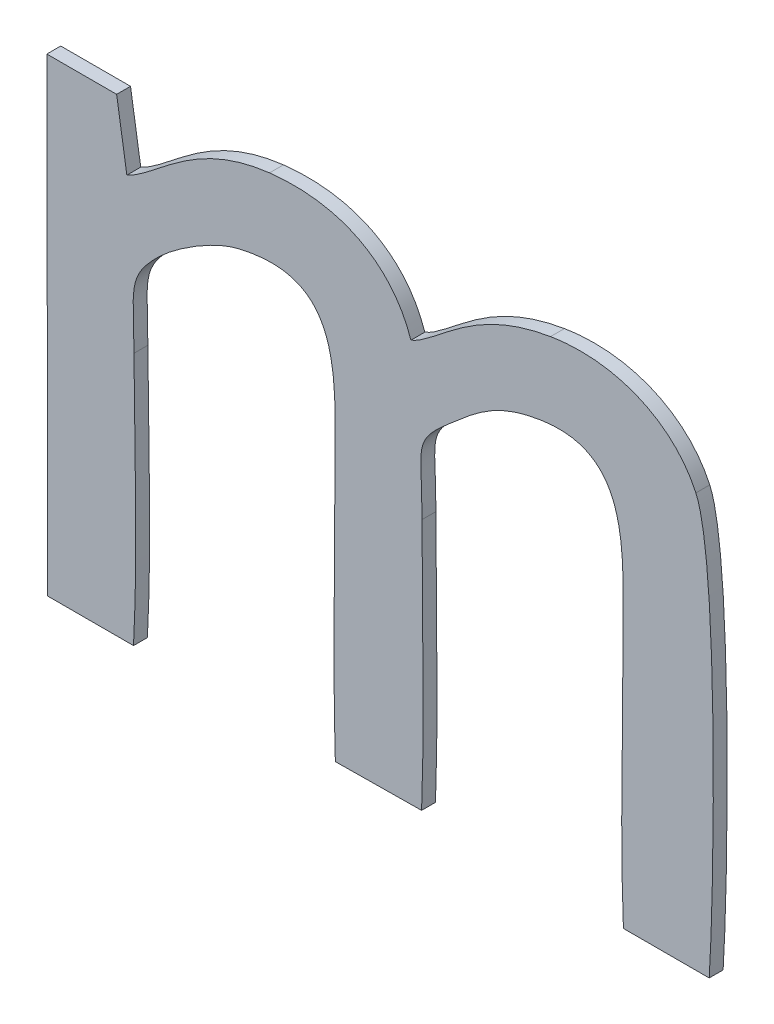
ISO-10303-21;
HEADER;
FILE_DESCRIPTION(('STEP AP214'),'2;1');
FILE_NAME('part.step','',(''),(''),'','','');
FILE_SCHEMA(('AUTOMOTIVE_DESIGN { 1 0 10303 214 1 1 1 1 }'));
ENDSEC;
DATA;
#1=APPLICATION_CONTEXT('core data for automotive mechanical design processes');
#2=APPLICATION_PROTOCOL_DEFINITION('international standard','automotive_design',2000,#1);
#3=PRODUCT_CONTEXT('',#1,'mechanical');
#4=PRODUCT('Part','Part','',(#3));
#5=PRODUCT_RELATED_PRODUCT_CATEGORY('part','',(#4));
#6=PRODUCT_DEFINITION_FORMATION('','',#4);
#7=PRODUCT_DEFINITION_CONTEXT('part definition',#1,'design');
#8=PRODUCT_DEFINITION('design','',#6,#7);
#9=PRODUCT_DEFINITION_SHAPE('','',#8);
#10=(LENGTH_UNIT() NAMED_UNIT(*) SI_UNIT(.MILLI.,.METRE.));
#11=(NAMED_UNIT(*) PLANE_ANGLE_UNIT() SI_UNIT($,.RADIAN.));
#12=(NAMED_UNIT(*) SI_UNIT($,.STERADIAN.) SOLID_ANGLE_UNIT());
#13=UNCERTAINTY_MEASURE_WITH_UNIT(LENGTH_MEASURE(1.E-05),#10,'distance_accuracy_value','');
#14=(GEOMETRIC_REPRESENTATION_CONTEXT(3) GLOBAL_UNCERTAINTY_ASSIGNED_CONTEXT((#13)) GLOBAL_UNIT_ASSIGNED_CONTEXT((#10,
#11,#12)) REPRESENTATION_CONTEXT('',''));
#15=CARTESIAN_POINT('',(0.,0.,0.));
#16=DIRECTION('',(0.,0.,1.));
#17=DIRECTION('',(1.,0.,0.));
#18=AXIS2_PLACEMENT_3D('',#15,#16,#17);
#19=CARTESIAN_POINT('',(-1.957379296875,-48.5519523828125,0.001));
#20=CARTESIAN_POINT('',(-1.957379296875,-48.5519523828125,0.));
#21=CARTESIAN_POINT('',(-1.958658984375,-48.5481453125,0.001));
#22=CARTESIAN_POINT('',(-1.958658984375,-48.5481453125,0.));
#23=CARTESIAN_POINT('',(-1.962242109375,-48.5460018359375,0.001));
#24=CARTESIAN_POINT('',(-1.962242109375,-48.5460018359375,0.));
#25=CARTESIAN_POINT('',(-1.9675528125,-48.5466096875,0.001));
#26=CARTESIAN_POINT('',(-1.9675528125,-48.5466096875,0.));
#27=B_SPLINE_SURFACE_WITH_KNOTS('',3,1,((#19,#20),(#21,#22),(#23,#24),(#25,#26)),.UNSPECIFIED.,
.F.,.F.,.F.,(4,4),(2,2),(0.681818181818182,0.727272727272727),(0.,1.),.UNSPECIFIED.);
#28=CARTESIAN_POINT('',(-1.957379296875,-48.5519523828125,0.));
#29=CARTESIAN_POINT('',(-1.958658984375,-48.5481453125,0.));
#30=CARTESIAN_POINT('',(-1.962242109375,-48.5460018359375,0.));
#31=CARTESIAN_POINT('',(-1.9675528125,-48.5466096875,0.));
#32=B_SPLINE_CURVE_WITH_KNOTS('',3,(#28,#29,#30,#31),.UNSPECIFIED.,.F.,.F.,(4,4),
(0.681818181818182,0.727272727272727),.UNSPECIFIED.);
#33=CARTESIAN_POINT('',(-1.957379296875,-48.5519523828125,0.));
#34=VERTEX_POINT('',#33);
#35=CARTESIAN_POINT('',(-1.9675528125,-48.5466096875,0.));
#36=VERTEX_POINT('',#35);
#37=EDGE_CURVE('E11',#34,#36,#32,.T.);
#38=DIRECTION('',(0.,0.,-1.));
#39=VECTOR('',#38,1.);
#40=CARTESIAN_POINT('',(-1.9675528125,-48.5466096875,0.001));
#41=LINE('',#40,#39);
#42=CARTESIAN_POINT('',(-1.9675528125,-48.5466096875,0.001));
#43=VERTEX_POINT('',#42);
#44=EDGE_CURVE('E28',#43,#36,#41,.T.);
#45=CARTESIAN_POINT('',(-1.957379296875,-48.5519523828125,0.001));
#46=CARTESIAN_POINT('',(-1.958658984375,-48.5481453125,0.001));
#47=CARTESIAN_POINT('',(-1.962242109375,-48.5460018359375,0.001));
#48=CARTESIAN_POINT('',(-1.9675528125,-48.5466096875,0.001));
#49=B_SPLINE_CURVE_WITH_KNOTS('',3,(#45,#46,#47,#48),.UNSPECIFIED.,.F.,.F.,(4,4),
(0.681818181818182,0.727272727272727),.UNSPECIFIED.);
#50=CARTESIAN_POINT('',(-1.957379296875,-48.5519523828125,0.001));
#51=VERTEX_POINT('',#50);
#52=EDGE_CURVE('E459',#51,#43,#49,.T.);
#53=DIRECTION('',(0.,0.,-1.));
#54=VECTOR('',#53,1.);
#55=CARTESIAN_POINT('',(-1.957379296875,-48.5519523828125,0.001));
#56=LINE('',#55,#54);
#57=EDGE_CURVE('E40',#51,#34,#56,.T.);
#58=ORIENTED_EDGE('',*,*,#37,.T.);
#59=ORIENTED_EDGE('',*,*,#44,.F.);
#60=ORIENTED_EDGE('',*,*,#52,.F.);
#61=ORIENTED_EDGE('',*,*,#57,.T.);
#62=EDGE_LOOP('',(#58,#59,#60,#61));
#63=FACE_BOUND('',#62,.T.);
#64=ADVANCED_FACE('F17',(#63),#27,.F.);
#65=CARTESIAN_POINT('',(-1.9675528125,-48.5466096875,0.001));
#66=CARTESIAN_POINT('',(-1.9675528125,-48.5466096875,0.));
#67=CARTESIAN_POINT('',(-1.9731514453125,-48.5472815234375,0.001));
#68=CARTESIAN_POINT('',(-1.9731514453125,-48.5472815234375,0.));
#69=CARTESIAN_POINT('',(-1.9755828515625,-48.5508646484375,0.001));
#70=CARTESIAN_POINT('',(-1.9755828515625,-48.5508646484375,0.));
#71=CARTESIAN_POINT('',(-1.9778223046875,-48.5518883984375,0.001));
#72=CARTESIAN_POINT('',(-1.9778223046875,-48.5518883984375,0.));
#73=B_SPLINE_SURFACE_WITH_KNOTS('',3,1,((#65,#66),(#67,#68),(#69,#70),(#71,#72)),.UNSPECIFIED.,
.F.,.F.,.F.,(4,4),(2,2),(0.727272727272727,0.772727272727273),(0.,1.),.UNSPECIFIED.);
#74=CARTESIAN_POINT('',(-1.9675528125,-48.5466096875,0.));
#75=CARTESIAN_POINT('',(-1.9731514453125,-48.5472815234375,0.));
#76=CARTESIAN_POINT('',(-1.9755828515625,-48.5508646484375,0.));
#77=CARTESIAN_POINT('',(-1.9778223046875,-48.5518883984375,0.));
#78=B_SPLINE_CURVE_WITH_KNOTS('',3,(#74,#75,#76,#77),.UNSPECIFIED.,.F.,.F.,(4,4),
(0.727272727272727,0.772727272727273),.UNSPECIFIED.);
#79=CARTESIAN_POINT('',(-1.9778223046875,-48.5518883984375,0.));
#80=VERTEX_POINT('',#79);
#81=EDGE_CURVE('E451',#36,#80,#78,.T.);
#82=DIRECTION('',(0.,0.,-1.));
#83=VECTOR('',#82,1.);
#84=CARTESIAN_POINT('',(-1.9778223046875,-48.5518883984375,0.001));
#85=LINE('',#84,#83);
#86=CARTESIAN_POINT('',(-1.9778223046875,-48.5518883984375,0.001));
#87=VERTEX_POINT('',#86);
#88=EDGE_CURVE('E446',#87,#80,#85,.T.);
#89=CARTESIAN_POINT('',(-1.9675528125,-48.5466096875,0.001));
#90=CARTESIAN_POINT('',(-1.9731514453125,-48.5472815234375,0.001));
#91=CARTESIAN_POINT('',(-1.9755828515625,-48.5508646484375,0.001));
#92=CARTESIAN_POINT('',(-1.9778223046875,-48.5518883984375,0.001));
#93=B_SPLINE_CURVE_WITH_KNOTS('',3,(#89,#90,#91,#92),.UNSPECIFIED.,.F.,.F.,(4,4),
(0.727272727272727,0.772727272727273),.UNSPECIFIED.);
#94=EDGE_CURVE('E442',#43,#87,#93,.T.);
#95=ORIENTED_EDGE('',*,*,#81,.T.);
#96=ORIENTED_EDGE('',*,*,#88,.F.);
#97=ORIENTED_EDGE('',*,*,#94,.F.);
#98=ORIENTED_EDGE('',*,*,#44,.T.);
#99=EDGE_LOOP('',(#95,#96,#97,#98));
#100=FACE_BOUND('',#99,.T.);
#101=ADVANCED_FACE('F467',(#100),#73,.F.);
#102=CARTESIAN_POINT('',(-9.3932937280294,-1.4797654503073,0.001));
#103=DIRECTION('',(-0.987817762671791,-0.155615126996373,0.));
#104=DIRECTION('',(0.155615126996373,-0.987817762671791,0.));
#105=AXIS2_PLACEMENT_3D('',#102,#103,#104);
#106=PLANE('',#105);
#107=DIRECTION('',(-0.155615126996373,0.987817762671791,0.));
#108=VECTOR('',#107,1.);
#109=CARTESIAN_POINT('',(-9.3932937280294,-1.4797654503073,0.));
#110=LINE('',#109,#108);
#111=CARTESIAN_POINT('',(-1.978558125,-48.5472175390625,0.));
#112=VERTEX_POINT('',#111);
#113=EDGE_CURVE('E440',#80,#112,#110,.T.);
#114=ORIENTED_EDGE('',*,*,#113,.T.);
#115=DIRECTION('',(0.,0.,-1.));
#116=VECTOR('',#115,1.);
#117=CARTESIAN_POINT('',(-1.978558125,-48.5472175390625,0.001));
#118=LINE('',#117,#116);
#119=CARTESIAN_POINT('',(-1.978558125,-48.5472175390625,0.001));
#120=VERTEX_POINT('',#119);
#121=EDGE_CURVE('E437',#120,#112,#118,.T.);
#122=ORIENTED_EDGE('',*,*,#121,.F.);
#123=DIRECTION('',(-0.155615126996373,0.987817762671791,0.));
#124=VECTOR('',#123,1.);
#125=CARTESIAN_POINT('',(-9.3932937280294,-1.4797654503073,0.001));
#126=LINE('',#125,#124);
#127=EDGE_CURVE('E434',#87,#120,#126,.T.);
#128=ORIENTED_EDGE('',*,*,#127,.F.);
#129=ORIENTED_EDGE('',*,*,#88,.T.);
#130=EDGE_LOOP('',(#114,#122,#128,#129));
#131=FACE_BOUND('',#130,.T.);
#132=ADVANCED_FACE('F471',(#131),#106,.F.);
#133=CARTESIAN_POINT('',(0.,-48.5472175390625,0.001));
#134=DIRECTION('',(0.,-1.,0.));
#135=DIRECTION('',(0.,0.,-1.));
#136=AXIS2_PLACEMENT_3D('',#133,#134,#135);
#137=PLANE('',#136);
#138=DIRECTION('',(-1.,0.,0.));
#139=VECTOR('',#138,1.);
#140=CARTESIAN_POINT('',(0.,-48.5472175390625,0.));
#141=LINE('',#140,#139);
#142=CARTESIAN_POINT('',(-1.9835808984375,-48.5472175390625,0.));
#143=VERTEX_POINT('',#142);
#144=EDGE_CURVE('E432',#112,#143,#141,.T.);
#145=ORIENTED_EDGE('',*,*,#144,.T.);
#146=DIRECTION('',(0.,0.,-1.));
#147=VECTOR('',#146,1.);
#148=CARTESIAN_POINT('',(-1.9835808984375,-48.5472175390625,0.001));
#149=LINE('',#148,#147);
#150=CARTESIAN_POINT('',(-1.9835808984375,-48.5472175390625,0.001));
#151=VERTEX_POINT('',#150);
#152=EDGE_CURVE('E429',#151,#143,#149,.T.);
#153=ORIENTED_EDGE('',*,*,#152,.F.);
#154=DIRECTION('',(-1.,0.,0.));
#155=VECTOR('',#154,1.);
#156=CARTESIAN_POINT('',(0.,-48.5472175390625,0.001));
#157=LINE('',#156,#155);
#158=EDGE_CURVE('E426',#120,#151,#157,.T.);
#159=ORIENTED_EDGE('',*,*,#158,.F.);
#160=ORIENTED_EDGE('',*,*,#121,.T.);
#161=EDGE_LOOP('',(#145,#153,#159,#160));
#162=FACE_BOUND('',#161,.T.);
#163=ADVANCED_FACE('F475',(#162),#137,.F.);
#164=CARTESIAN_POINT('',(-2.0756060789896,-0.00393479825404389,0.001));
#165=DIRECTION('',(0.999998203100012,0.0018957311907279,0.));
#166=DIRECTION('',(-0.0018957311907279,0.999998203100012,0.));
#167=AXIS2_PLACEMENT_3D('',#164,#165,#166);
#168=PLANE('',#167);
#169=DIRECTION('',(0.0018957311907279,-0.999998203100012,0.));
#170=VECTOR('',#169,1.);
#171=CARTESIAN_POINT('',(-2.0756060789896,-0.00393479825404389,0.));
#172=LINE('',#171,#170);
#173=CARTESIAN_POINT('',(-1.9835169140625,-48.580969296875,0.));
#174=VERTEX_POINT('',#173);
#175=EDGE_CURVE('E424',#143,#174,#172,.T.);
#176=ORIENTED_EDGE('',*,*,#175,.T.);
#177=DIRECTION('',(0.,0.,-1.));
#178=VECTOR('',#177,1.);
#179=CARTESIAN_POINT('',(-1.9835169140625,-48.580969296875,0.001));
#180=LINE('',#179,#178);
#181=CARTESIAN_POINT('',(-1.9835169140625,-48.580969296875,0.001));
#182=VERTEX_POINT('',#181);
#183=EDGE_CURVE('E421',#182,#174,#180,.T.);
#184=ORIENTED_EDGE('',*,*,#183,.F.);
#185=DIRECTION('',(0.0018957311907279,-0.999998203100012,0.));
#186=VECTOR('',#185,1.);
#187=CARTESIAN_POINT('',(-2.0756060789896,-0.00393479825404389,0.001));
#188=LINE('',#187,#186);
#189=EDGE_CURVE('E418',#151,#182,#188,.T.);
#190=ORIENTED_EDGE('',*,*,#189,.F.);
#191=ORIENTED_EDGE('',*,*,#152,.T.);
#192=EDGE_LOOP('',(#176,#184,#190,#191));
#193=FACE_BOUND('',#192,.T.);
#194=ADVANCED_FACE('F479',(#193),#168,.F.);
#195=CARTESIAN_POINT('',(0.,-48.580969296875,0.001));
#196=DIRECTION('',(0.,1.,0.));
#197=DIRECTION('',(0.,0.,1.));
#198=AXIS2_PLACEMENT_3D('',#195,#196,#197);
#199=PLANE('',#198);
#200=DIRECTION('',(1.,0.,0.));
#201=VECTOR('',#200,1.);
#202=CARTESIAN_POINT('',(0.,-48.580969296875,0.));
#203=LINE('',#202,#201);
#204=CARTESIAN_POINT('',(-1.977342421875,-48.580969296875,0.));
#205=VERTEX_POINT('',#204);
#206=EDGE_CURVE('E416',#174,#205,#203,.T.);
#207=ORIENTED_EDGE('',*,*,#206,.T.);
#208=DIRECTION('',(0.,0.,-1.));
#209=VECTOR('',#208,1.);
#210=CARTESIAN_POINT('',(-1.977342421875,-48.580969296875,0.001));
#211=LINE('',#210,#209);
#212=CARTESIAN_POINT('',(-1.977342421875,-48.580969296875,0.001));
#213=VERTEX_POINT('',#212);
#214=EDGE_CURVE('E413',#213,#205,#211,.T.);
#215=ORIENTED_EDGE('',*,*,#214,.F.);
#216=DIRECTION('',(1.,0.,0.));
#217=VECTOR('',#216,1.);
#218=CARTESIAN_POINT('',(0.,-48.580969296875,0.001));
#219=LINE('',#218,#217);
#220=EDGE_CURVE('E407',#182,#213,#219,.T.);
#221=ORIENTED_EDGE('',*,*,#220,.F.);
#222=ORIENTED_EDGE('',*,*,#183,.T.);
#223=EDGE_LOOP('',(#207,#215,#221,#222));
#224=FACE_BOUND('',#223,.T.);
#225=ADVANCED_FACE('F486',(#224),#199,.F.);
#226=CARTESIAN_POINT('',(-1.977342421875,-48.580969296875,0.001));
#227=CARTESIAN_POINT('',(-1.977342421875,-48.580969296875,0.));
#228=CARTESIAN_POINT('',(-1.9770225,-48.5751787109375,0.001));
#229=CARTESIAN_POINT('',(-1.9770225,-48.5751787109375,0.));
#230=CARTESIAN_POINT('',(-1.9772784375,-48.5685883203125,0.001));
#231=CARTESIAN_POINT('',(-1.9772784375,-48.5685883203125,0.));
#232=CARTESIAN_POINT('',(-1.9773104296875,-48.56273375,0.001));
#233=CARTESIAN_POINT('',(-1.9773104296875,-48.56273375,0.));
#234=B_SPLINE_SURFACE_WITH_KNOTS('',3,1,((#226,#227),(#228,#229),(#230,#231),(#232,#233)),
.UNSPECIFIED.,.F.,.F.,.F.,(4,4),(2,2),(0.,0.0454545454545455),(0.,1.),.UNSPECIFIED.);
#235=CARTESIAN_POINT('',(-1.977342421875,-48.580969296875,0.));
#236=CARTESIAN_POINT('',(-1.9770225,-48.5751787109375,0.));
#237=CARTESIAN_POINT('',(-1.9772784375,-48.5685883203125,0.));
#238=CARTESIAN_POINT('',(-1.9773104296875,-48.56273375,0.));
#239=B_SPLINE_CURVE_WITH_KNOTS('',3,(#235,#236,#237,#238),.UNSPECIFIED.,.F.,.F.,(4,4),(0.,
0.0454545454545455),.UNSPECIFIED.);
#240=CARTESIAN_POINT('',(-1.9773104296875,-48.56273375,0.));
#241=VERTEX_POINT('',#240);
#242=EDGE_CURVE('E402',#205,#241,#239,.T.);
#243=DIRECTION('',(0.,0.,-1.));
#244=VECTOR('',#243,1.);
#245=CARTESIAN_POINT('',(-1.9773104296875,-48.56273375,0.001));
#246=LINE('',#245,#244);
#247=CARTESIAN_POINT('',(-1.9773104296875,-48.56273375,0.001));
#248=VERTEX_POINT('',#247);
#249=EDGE_CURVE('E397',#248,#241,#246,.T.);
#250=CARTESIAN_POINT('',(-1.977342421875,-48.580969296875,0.001));
#251=CARTESIAN_POINT('',(-1.9770225,-48.5751787109375,0.001));
#252=CARTESIAN_POINT('',(-1.9772784375,-48.5685883203125,0.001));
#253=CARTESIAN_POINT('',(-1.9773104296875,-48.56273375,0.001));
#254=B_SPLINE_CURVE_WITH_KNOTS('',3,(#250,#251,#252,#253),.UNSPECIFIED.,.F.,.F.,(4,4),(0.,
0.0454545454545455),.UNSPECIFIED.);
#255=EDGE_CURVE('E390',#213,#248,#254,.T.);
#256=ORIENTED_EDGE('',*,*,#242,.T.);
#257=ORIENTED_EDGE('',*,*,#249,.F.);
#258=ORIENTED_EDGE('',*,*,#255,.F.);
#259=ORIENTED_EDGE('',*,*,#214,.T.);
#260=EDGE_LOOP('',(#256,#257,#258,#259));
#261=FACE_BOUND('',#260,.T.);
#262=ADVANCED_FACE('F490',(#261),#234,.F.);
#263=CARTESIAN_POINT('',(-1.9773104296875,-48.56273375,0.001));
#264=CARTESIAN_POINT('',(-1.9773104296875,-48.56273375,0.));
#265=CARTESIAN_POINT('',(-1.9773104296875,-48.5587347265625,0.001));
#266=CARTESIAN_POINT('',(-1.9773104296875,-48.5587347265625,0.));
#267=CARTESIAN_POINT('',(-1.9778862890625,-48.5580948828125,0.001));
#268=CARTESIAN_POINT('',(-1.9778862890625,-48.5580948828125,0.));
#269=CARTESIAN_POINT('',(-1.9754548828125,-48.555759453125,0.001));
#270=CARTESIAN_POINT('',(-1.9754548828125,-48.555759453125,0.));
#271=B_SPLINE_SURFACE_WITH_KNOTS('',3,1,((#263,#264),(#265,#266),(#267,#268),(#269,#270)),
.UNSPECIFIED.,.F.,.F.,.F.,(4,4),(2,2),(0.0454545454545455,0.0909090909090909),(0.,1.),.UNSPECIFIED.);
#272=CARTESIAN_POINT('',(-1.9773104296875,-48.56273375,0.));
#273=CARTESIAN_POINT('',(-1.9773104296875,-48.5587347265625,0.));
#274=CARTESIAN_POINT('',(-1.9778862890625,-48.5580948828125,0.));
#275=CARTESIAN_POINT('',(-1.9754548828125,-48.555759453125,0.));
#276=B_SPLINE_CURVE_WITH_KNOTS('',3,(#272,#273,#274,#275),.UNSPECIFIED.,.F.,.F.,(4,4),
(0.0454545454545455,0.0909090909090909),.UNSPECIFIED.);
#277=CARTESIAN_POINT('',(-1.9754548828125,-48.555759453125,0.));
#278=VERTEX_POINT('',#277);
#279=EDGE_CURVE('E385',#241,#278,#276,.T.);
#280=DIRECTION('',(0.,0.,-1.));
#281=VECTOR('',#280,1.);
#282=CARTESIAN_POINT('',(-1.9754548828125,-48.555759453125,0.001));
#283=LINE('',#282,#281);
#284=CARTESIAN_POINT('',(-1.9754548828125,-48.555759453125,0.001));
#285=VERTEX_POINT('',#284);
#286=EDGE_CURVE('E380',#285,#278,#283,.T.);
#287=CARTESIAN_POINT('',(-1.9773104296875,-48.56273375,0.001));
#288=CARTESIAN_POINT('',(-1.9773104296875,-48.5587347265625,0.001));
#289=CARTESIAN_POINT('',(-1.9778862890625,-48.5580948828125,0.001));
#290=CARTESIAN_POINT('',(-1.9754548828125,-48.555759453125,0.001));
#291=B_SPLINE_CURVE_WITH_KNOTS('',3,(#287,#288,#289,#290),.UNSPECIFIED.,.F.,.F.,(4,4),
(0.0454545454545455,0.0909090909090909),.UNSPECIFIED.);
#292=EDGE_CURVE('E373',#248,#285,#291,.T.);
#293=ORIENTED_EDGE('',*,*,#279,.T.);
#294=ORIENTED_EDGE('',*,*,#286,.F.);
#295=ORIENTED_EDGE('',*,*,#292,.F.);
#296=ORIENTED_EDGE('',*,*,#249,.T.);
#297=EDGE_LOOP('',(#293,#294,#295,#296));
#298=FACE_BOUND('',#297,.T.);
#299=ADVANCED_FACE('F497',(#298),#271,.F.);
#300=CARTESIAN_POINT('',(-1.9754548828125,-48.555759453125,0.001));
#301=CARTESIAN_POINT('',(-1.9754548828125,-48.555759453125,0.));
#302=CARTESIAN_POINT('',(-1.974399140625,-48.554735703125,0.001));
#303=CARTESIAN_POINT('',(-1.974399140625,-48.554735703125,0.));
#304=CARTESIAN_POINT('',(-1.97177578125,-48.552944140625,0.001));
#305=CARTESIAN_POINT('',(-1.97177578125,-48.552944140625,0.));
#306=CARTESIAN_POINT('',(-1.9698242578125,-48.5524642578125,0.001));
#307=CARTESIAN_POINT('',(-1.9698242578125,-48.5524642578125,0.));
#308=B_SPLINE_SURFACE_WITH_KNOTS('',3,1,((#300,#301),(#302,#303),(#304,#305),(#306,#307)),
.UNSPECIFIED.,.F.,.F.,.F.,(4,4),(2,2),(0.0909090909090909,0.136363636363636),(0.,1.),.UNSPECIFIED.);
#309=CARTESIAN_POINT('',(-1.9754548828125,-48.555759453125,0.));
#310=CARTESIAN_POINT('',(-1.974399140625,-48.554735703125,0.));
#311=CARTESIAN_POINT('',(-1.97177578125,-48.552944140625,0.));
#312=CARTESIAN_POINT('',(-1.9698242578125,-48.5524642578125,0.));
#313=B_SPLINE_CURVE_WITH_KNOTS('',3,(#309,#310,#311,#312),.UNSPECIFIED.,.F.,.F.,(4,4),
(0.0909090909090909,0.136363636363636),.UNSPECIFIED.);
#314=CARTESIAN_POINT('',(-1.9698242578125,-48.5524642578125,0.));
#315=VERTEX_POINT('',#314);
#316=EDGE_CURVE('E368',#278,#315,#313,.T.);
#317=DIRECTION('',(0.,0.,-1.));
#318=VECTOR('',#317,1.);
#319=CARTESIAN_POINT('',(-1.9698242578125,-48.5524642578125,0.001));
#320=LINE('',#319,#318);
#321=CARTESIAN_POINT('',(-1.9698242578125,-48.5524642578125,0.001));
#322=VERTEX_POINT('',#321);
#323=EDGE_CURVE('E363',#322,#315,#320,.T.);
#324=CARTESIAN_POINT('',(-1.9754548828125,-48.555759453125,0.001));
#325=CARTESIAN_POINT('',(-1.974399140625,-48.554735703125,0.001));
#326=CARTESIAN_POINT('',(-1.97177578125,-48.552944140625,0.001));
#327=CARTESIAN_POINT('',(-1.9698242578125,-48.5524642578125,0.001));
#328=B_SPLINE_CURVE_WITH_KNOTS('',3,(#324,#325,#326,#327),.UNSPECIFIED.,.F.,.F.,(4,4),
(0.0909090909090909,0.136363636363636),.UNSPECIFIED.);
#329=EDGE_CURVE('E356',#285,#322,#328,.T.);
#330=ORIENTED_EDGE('',*,*,#316,.T.);
#331=ORIENTED_EDGE('',*,*,#323,.F.);
#332=ORIENTED_EDGE('',*,*,#329,.F.);
#333=ORIENTED_EDGE('',*,*,#286,.T.);
#334=EDGE_LOOP('',(#330,#331,#332,#333));
#335=FACE_BOUND('',#334,.T.);
#336=ADVANCED_FACE('F500',(#335),#308,.F.);
#337=CARTESIAN_POINT('',(-1.9698242578125,-48.5524642578125,0.001));
#338=CARTESIAN_POINT('',(-1.9698242578125,-48.5524642578125,0.));
#339=CARTESIAN_POINT('',(-1.96205015625,-48.55057671875,0.001));
#340=CARTESIAN_POINT('',(-1.96205015625,-48.55057671875,0.));
#341=CARTESIAN_POINT('',(-1.9628499609375,-48.55723109375,0.001));
#342=CARTESIAN_POINT('',(-1.9628499609375,-48.55723109375,0.));
#343=CARTESIAN_POINT('',(-1.9628499609375,-48.5631496484375,0.001));
#344=CARTESIAN_POINT('',(-1.9628499609375,-48.5631496484375,0.));
#345=B_SPLINE_SURFACE_WITH_KNOTS('',3,1,((#337,#338),(#339,#340),(#341,#342),(#343,#344)),
.UNSPECIFIED.,.F.,.F.,.F.,(4,4),(2,2),(0.136363636363636,0.181818181818182),(0.,1.),.UNSPECIFIED.);
#346=CARTESIAN_POINT('',(-1.9698242578125,-48.5524642578125,0.));
#347=CARTESIAN_POINT('',(-1.96205015625,-48.55057671875,0.));
#348=CARTESIAN_POINT('',(-1.9628499609375,-48.55723109375,0.));
#349=CARTESIAN_POINT('',(-1.9628499609375,-48.5631496484375,0.));
#350=B_SPLINE_CURVE_WITH_KNOTS('',3,(#346,#347,#348,#349),.UNSPECIFIED.,.F.,.F.,(4,4),
(0.136363636363636,0.181818181818182),.UNSPECIFIED.);
#351=CARTESIAN_POINT('',(-1.9628499609375,-48.5631496484375,0.));
#352=VERTEX_POINT('',#351);
#353=EDGE_CURVE('E351',#315,#352,#350,.T.);
#354=DIRECTION('',(0.,0.,-1.));
#355=VECTOR('',#354,1.);
#356=CARTESIAN_POINT('',(-1.9628499609375,-48.5631496484375,0.001));
#357=LINE('',#356,#355);
#358=CARTESIAN_POINT('',(-1.9628499609375,-48.5631496484375,0.001));
#359=VERTEX_POINT('',#358);
#360=EDGE_CURVE('E346',#359,#352,#357,.T.);
#361=CARTESIAN_POINT('',(-1.9698242578125,-48.5524642578125,0.001));
#362=CARTESIAN_POINT('',(-1.96205015625,-48.55057671875,0.001));
#363=CARTESIAN_POINT('',(-1.9628499609375,-48.55723109375,0.001));
#364=CARTESIAN_POINT('',(-1.9628499609375,-48.5631496484375,0.001));
#365=B_SPLINE_CURVE_WITH_KNOTS('',3,(#361,#362,#363,#364),.UNSPECIFIED.,.F.,.F.,(4,4),
(0.136363636363636,0.181818181818182),.UNSPECIFIED.);
#366=EDGE_CURVE('E339',#322,#359,#365,.T.);
#367=ORIENTED_EDGE('',*,*,#353,.T.);
#368=ORIENTED_EDGE('',*,*,#360,.F.);
#369=ORIENTED_EDGE('',*,*,#366,.F.);
#370=ORIENTED_EDGE('',*,*,#323,.T.);
#371=EDGE_LOOP('',(#367,#368,#369,#370));
#372=FACE_BOUND('',#371,.T.);
#373=ADVANCED_FACE('F505',(#372),#345,.F.);
#374=CARTESIAN_POINT('',(-1.9628499609375,-48.5631496484375,0.001));
#375=CARTESIAN_POINT('',(-1.9628499609375,-48.5631496484375,0.));
#376=CARTESIAN_POINT('',(-1.9628499609375,-48.5689722265625,0.001));
#377=CARTESIAN_POINT('',(-1.9628499609375,-48.5689722265625,0.));
#378=CARTESIAN_POINT('',(-1.963009921875,-48.5749867578125,0.001));
#379=CARTESIAN_POINT('',(-1.963009921875,-48.5749867578125,0.));
#380=CARTESIAN_POINT('',(-1.96281796875,-48.5809373046875,0.001));
#381=CARTESIAN_POINT('',(-1.96281796875,-48.5809373046875,0.));
#382=B_SPLINE_SURFACE_WITH_KNOTS('',3,1,((#374,#375),(#376,#377),(#378,#379),(#380,#381)),
.UNSPECIFIED.,.F.,.F.,.F.,(4,4),(2,2),(0.181818181818182,0.227272727272727),(0.,1.),.UNSPECIFIED.);
#383=CARTESIAN_POINT('',(-1.9628499609375,-48.5631496484375,0.));
#384=CARTESIAN_POINT('',(-1.9628499609375,-48.5689722265625,0.));
#385=CARTESIAN_POINT('',(-1.963009921875,-48.5749867578125,0.));
#386=CARTESIAN_POINT('',(-1.96281796875,-48.5809373046875,0.));
#387=B_SPLINE_CURVE_WITH_KNOTS('',3,(#383,#384,#385,#386),.UNSPECIFIED.,.F.,.F.,(4,4),
(0.181818181818182,0.227272727272727),.UNSPECIFIED.);
#388=CARTESIAN_POINT('',(-1.96281796875,-48.5809373046875,0.));
#389=VERTEX_POINT('',#388);
#390=EDGE_CURVE('E334',#352,#389,#387,.T.);
#391=DIRECTION('',(0.,0.,-1.));
#392=VECTOR('',#391,1.);
#393=CARTESIAN_POINT('',(-1.96281796875,-48.5809373046875,0.001));
#394=LINE('',#393,#392);
#395=CARTESIAN_POINT('',(-1.96281796875,-48.5809373046875,0.001));
#396=VERTEX_POINT('',#395);
#397=EDGE_CURVE('E329',#396,#389,#394,.T.);
#398=CARTESIAN_POINT('',(-1.9628499609375,-48.5631496484375,0.001));
#399=CARTESIAN_POINT('',(-1.9628499609375,-48.5689722265625,0.001));
#400=CARTESIAN_POINT('',(-1.963009921875,-48.5749867578125,0.001));
#401=CARTESIAN_POINT('',(-1.96281796875,-48.5809373046875,0.001));
#402=B_SPLINE_CURVE_WITH_KNOTS('',3,(#398,#399,#400,#401),.UNSPECIFIED.,.F.,.F.,(4,4),
(0.181818181818182,0.227272727272727),.UNSPECIFIED.);
#403=EDGE_CURVE('E325',#359,#396,#402,.T.);
#404=ORIENTED_EDGE('',*,*,#390,.T.);
#405=ORIENTED_EDGE('',*,*,#397,.F.);
#406=ORIENTED_EDGE('',*,*,#403,.F.);
#407=ORIENTED_EDGE('',*,*,#360,.T.);
#408=EDGE_LOOP('',(#404,#405,#406,#407));
#409=FACE_BOUND('',#408,.T.);
#410=ADVANCED_FACE('F511',(#409),#382,.F.);
#411=CARTESIAN_POINT('',(0.500572593100432,-48.5555415256967,0.001));
#412=DIRECTION('',(-0.0103087305539108,0.999946863625446,0.));
#413=DIRECTION('',(-0.999946863625446,-0.0103087305539108,0.));
#414=AXIS2_PLACEMENT_3D('',#411,#412,#413);
#415=PLANE('',#414);
#416=DIRECTION('',(0.999946863625446,0.0103087305539108,0.));
#417=VECTOR('',#416,1.);
#418=CARTESIAN_POINT('',(0.500572593100432,-48.5555415256967,0.));
#419=LINE('',#418,#417);
#420=CARTESIAN_POINT('',(-1.956611484375,-48.5808733203125,0.));
#421=VERTEX_POINT('',#420);
#422=EDGE_CURVE('E323',#389,#421,#419,.T.);
#423=ORIENTED_EDGE('',*,*,#422,.T.);
#424=DIRECTION('',(0.,0.,-1.));
#425=VECTOR('',#424,1.);
#426=CARTESIAN_POINT('',(-1.956611484375,-48.5808733203125,0.001));
#427=LINE('',#426,#425);
#428=CARTESIAN_POINT('',(-1.956611484375,-48.5808733203125,0.001));
#429=VERTEX_POINT('',#428);
#430=EDGE_CURVE('E320',#429,#421,#427,.T.);
#431=ORIENTED_EDGE('',*,*,#430,.F.);
#432=DIRECTION('',(0.999946863625446,0.0103087305539108,0.));
#433=VECTOR('',#432,1.);
#434=CARTESIAN_POINT('',(0.500572593100432,-48.5555415256967,0.001));
#435=LINE('',#434,#433);
#436=EDGE_CURVE('E314',#396,#429,#435,.T.);
#437=ORIENTED_EDGE('',*,*,#436,.F.);
#438=ORIENTED_EDGE('',*,*,#397,.T.);
#439=EDGE_LOOP('',(#423,#431,#437,#438));
#440=FACE_BOUND('',#439,.T.);
#441=ADVANCED_FACE('F515',(#440),#415,.F.);
#442=CARTESIAN_POINT('',(-1.956611484375,-48.5808733203125,0.001));
#443=CARTESIAN_POINT('',(-1.956611484375,-48.5808733203125,0.));
#444=CARTESIAN_POINT('',(-1.9563875390625,-48.5749867578125,0.001));
#445=CARTESIAN_POINT('',(-1.9563875390625,-48.5749867578125,0.));
#446=CARTESIAN_POINT('',(-1.9565794921875,-48.568684296875,0.001));
#447=CARTESIAN_POINT('',(-1.9565794921875,-48.568684296875,0.));
#448=CARTESIAN_POINT('',(-1.9565794921875,-48.56273375,0.001));
#449=CARTESIAN_POINT('',(-1.9565794921875,-48.56273375,0.));
#450=B_SPLINE_SURFACE_WITH_KNOTS('',3,1,((#442,#443),(#444,#445),(#446,#447),(#448,#449)),
.UNSPECIFIED.,.F.,.F.,.F.,(4,4),(2,2),(0.272727272727273,0.318181818181818),(0.,1.),.UNSPECIFIED.);
#451=CARTESIAN_POINT('',(-1.956611484375,-48.5808733203125,0.));
#452=CARTESIAN_POINT('',(-1.9563875390625,-48.5749867578125,0.));
#453=CARTESIAN_POINT('',(-1.9565794921875,-48.568684296875,0.));
#454=CARTESIAN_POINT('',(-1.9565794921875,-48.56273375,0.));
#455=B_SPLINE_CURVE_WITH_KNOTS('',3,(#451,#452,#453,#454),.UNSPECIFIED.,.F.,.F.,(4,4),
(0.272727272727273,0.318181818181818),.UNSPECIFIED.);
#456=CARTESIAN_POINT('',(-1.9565794921875,-48.56273375,0.));
#457=VERTEX_POINT('',#456);
#458=EDGE_CURVE('E309',#421,#457,#455,.T.);
#459=DIRECTION('',(0.,0.,-1.));
#460=VECTOR('',#459,1.);
#461=CARTESIAN_POINT('',(-1.9565794921875,-48.56273375,0.001));
#462=LINE('',#461,#460);
#463=CARTESIAN_POINT('',(-1.9565794921875,-48.56273375,0.001));
#464=VERTEX_POINT('',#463);
#465=EDGE_CURVE('E304',#464,#457,#462,.T.);
#466=CARTESIAN_POINT('',(-1.956611484375,-48.5808733203125,0.001));
#467=CARTESIAN_POINT('',(-1.9563875390625,-48.5749867578125,0.001));
#468=CARTESIAN_POINT('',(-1.9565794921875,-48.568684296875,0.001));
#469=CARTESIAN_POINT('',(-1.9565794921875,-48.56273375,0.001));
#470=B_SPLINE_CURVE_WITH_KNOTS('',3,(#466,#467,#468,#469),.UNSPECIFIED.,.F.,.F.,(4,4),
(0.272727272727273,0.318181818181818),.UNSPECIFIED.);
#471=EDGE_CURVE('E297',#429,#464,#470,.T.);
#472=ORIENTED_EDGE('',*,*,#458,.T.);
#473=ORIENTED_EDGE('',*,*,#465,.F.);
#474=ORIENTED_EDGE('',*,*,#471,.F.);
#475=ORIENTED_EDGE('',*,*,#430,.T.);
#476=EDGE_LOOP('',(#472,#473,#474,#475));
#477=FACE_BOUND('',#476,.T.);
#478=ADVANCED_FACE('F518',(#477),#450,.F.);
#479=CARTESIAN_POINT('',(-1.9565794921875,-48.56273375,0.001));
#480=CARTESIAN_POINT('',(-1.9565794921875,-48.56273375,0.));
#481=CARTESIAN_POINT('',(-1.9565794921875,-48.558062890625,0.001));
#482=CARTESIAN_POINT('',(-1.9565794921875,-48.558062890625,0.));
#483=CARTESIAN_POINT('',(-1.9573153125,-48.5580948828125,0.001));
#484=CARTESIAN_POINT('',(-1.9573153125,-48.5580948828125,0.));
#485=CARTESIAN_POINT('',(-1.954563984375,-48.5557274609375,0.001));
#486=CARTESIAN_POINT('',(-1.954563984375,-48.5557274609375,0.));
#487=B_SPLINE_SURFACE_WITH_KNOTS('',3,1,((#479,#480),(#481,#482),(#483,#484),(#485,#486)),
.UNSPECIFIED.,.F.,.F.,.F.,(4,4),(2,2),(0.318181818181818,0.363636363636364),(0.,1.),.UNSPECIFIED.);
#488=CARTESIAN_POINT('',(-1.9565794921875,-48.56273375,0.));
#489=CARTESIAN_POINT('',(-1.9565794921875,-48.558062890625,0.));
#490=CARTESIAN_POINT('',(-1.9573153125,-48.5580948828125,0.));
#491=CARTESIAN_POINT('',(-1.954563984375,-48.5557274609375,0.));
#492=B_SPLINE_CURVE_WITH_KNOTS('',3,(#488,#489,#490,#491),.UNSPECIFIED.,.F.,.F.,(4,4),
(0.318181818181818,0.363636363636364),.UNSPECIFIED.);
#493=CARTESIAN_POINT('',(-1.954563984375,-48.5557274609375,0.));
#494=VERTEX_POINT('',#493);
#495=EDGE_CURVE('E292',#457,#494,#492,.T.);
#496=DIRECTION('',(0.,0.,-1.));
#497=VECTOR('',#496,1.);
#498=CARTESIAN_POINT('',(-1.954563984375,-48.5557274609375,0.001));
#499=LINE('',#498,#497);
#500=CARTESIAN_POINT('',(-1.954563984375,-48.5557274609375,0.001));
#501=VERTEX_POINT('',#500);
#502=EDGE_CURVE('E287',#501,#494,#499,.T.);
#503=CARTESIAN_POINT('',(-1.9565794921875,-48.56273375,0.001));
#504=CARTESIAN_POINT('',(-1.9565794921875,-48.558062890625,0.001));
#505=CARTESIAN_POINT('',(-1.9573153125,-48.5580948828125,0.001));
#506=CARTESIAN_POINT('',(-1.954563984375,-48.5557274609375,0.001));
#507=B_SPLINE_CURVE_WITH_KNOTS('',3,(#503,#504,#505,#506),.UNSPECIFIED.,.F.,.F.,(4,4),
(0.318181818181818,0.363636363636364),.UNSPECIFIED.);
#508=EDGE_CURVE('E280',#464,#501,#507,.T.);
#509=ORIENTED_EDGE('',*,*,#495,.T.);
#510=ORIENTED_EDGE('',*,*,#502,.F.);
#511=ORIENTED_EDGE('',*,*,#508,.F.);
#512=ORIENTED_EDGE('',*,*,#465,.T.);
#513=EDGE_LOOP('',(#509,#510,#511,#512));
#514=FACE_BOUND('',#513,.T.);
#515=ADVANCED_FACE('F525',(#514),#487,.F.);
#516=CARTESIAN_POINT('',(-1.954563984375,-48.5557274609375,0.001));
#517=CARTESIAN_POINT('',(-1.954563984375,-48.5557274609375,0.));
#518=CARTESIAN_POINT('',(-1.952964375,-48.554351796875,0.001));
#519=CARTESIAN_POINT('',(-1.952964375,-48.554351796875,0.));
#520=CARTESIAN_POINT('',(-1.9515247265625,-48.553008125,0.001));
#521=CARTESIAN_POINT('',(-1.9515247265625,-48.553008125,0.));
#522=CARTESIAN_POINT('',(-1.948933359375,-48.552432265625,0.001));
#523=CARTESIAN_POINT('',(-1.948933359375,-48.552432265625,0.));
#524=B_SPLINE_SURFACE_WITH_KNOTS('',3,1,((#516,#517),(#518,#519),(#520,#521),(#522,#523)),
.UNSPECIFIED.,.F.,.F.,.F.,(4,4),(2,2),(0.363636363636364,0.409090909090909),(0.,1.),.UNSPECIFIED.);
#525=CARTESIAN_POINT('',(-1.954563984375,-48.5557274609375,0.));
#526=CARTESIAN_POINT('',(-1.952964375,-48.554351796875,0.));
#527=CARTESIAN_POINT('',(-1.9515247265625,-48.553008125,0.));
#528=CARTESIAN_POINT('',(-1.948933359375,-48.552432265625,0.));
#529=B_SPLINE_CURVE_WITH_KNOTS('',3,(#525,#526,#527,#528),.UNSPECIFIED.,.F.,.F.,(4,4),
(0.363636363636364,0.409090909090909),.UNSPECIFIED.);
#530=CARTESIAN_POINT('',(-1.948933359375,-48.552432265625,0.));
#531=VERTEX_POINT('',#530);
#532=EDGE_CURVE('E275',#494,#531,#529,.T.);
#533=DIRECTION('',(0.,0.,-1.));
#534=VECTOR('',#533,1.);
#535=CARTESIAN_POINT('',(-1.948933359375,-48.552432265625,0.001));
#536=LINE('',#535,#534);
#537=CARTESIAN_POINT('',(-1.948933359375,-48.552432265625,0.001));
#538=VERTEX_POINT('',#537);
#539=EDGE_CURVE('E270',#538,#531,#536,.T.);
#540=CARTESIAN_POINT('',(-1.954563984375,-48.5557274609375,0.001));
#541=CARTESIAN_POINT('',(-1.952964375,-48.554351796875,0.001));
#542=CARTESIAN_POINT('',(-1.9515247265625,-48.553008125,0.001));
#543=CARTESIAN_POINT('',(-1.948933359375,-48.552432265625,0.001));
#544=B_SPLINE_CURVE_WITH_KNOTS('',3,(#540,#541,#542,#543),.UNSPECIFIED.,.F.,.F.,(4,4),
(0.363636363636364,0.409090909090909),.UNSPECIFIED.);
#545=EDGE_CURVE('E263',#501,#538,#544,.T.);
#546=ORIENTED_EDGE('',*,*,#532,.T.);
#547=ORIENTED_EDGE('',*,*,#539,.F.);
#548=ORIENTED_EDGE('',*,*,#545,.F.);
#549=ORIENTED_EDGE('',*,*,#502,.T.);
#550=EDGE_LOOP('',(#546,#547,#548,#549));
#551=FACE_BOUND('',#550,.T.);
#552=ADVANCED_FACE('F532',(#551),#524,.F.);
#553=CARTESIAN_POINT('',(-1.948933359375,-48.552432265625,0.001));
#554=CARTESIAN_POINT('',(-1.948933359375,-48.552432265625,0.));
#555=CARTESIAN_POINT('',(-1.941383203125,-48.5506726953125,0.001));
#556=CARTESIAN_POINT('',(-1.941383203125,-48.5506726953125,0.));
#557=CARTESIAN_POINT('',(-1.9421190234375,-48.5574550390625,0.001));
#558=CARTESIAN_POINT('',(-1.9421190234375,-48.5574550390625,0.));
#559=CARTESIAN_POINT('',(-1.9421190234375,-48.5631496484375,0.001));
#560=CARTESIAN_POINT('',(-1.9421190234375,-48.5631496484375,0.));
#561=B_SPLINE_SURFACE_WITH_KNOTS('',3,1,((#553,#554),(#555,#556),(#557,#558),(#559,#560)),
.UNSPECIFIED.,.F.,.F.,.F.,(4,4),(2,2),(0.409090909090909,0.454545454545455),(0.,1.),.UNSPECIFIED.);
#562=CARTESIAN_POINT('',(-1.948933359375,-48.552432265625,0.));
#563=CARTESIAN_POINT('',(-1.941383203125,-48.5506726953125,0.));
#564=CARTESIAN_POINT('',(-1.9421190234375,-48.5574550390625,0.));
#565=CARTESIAN_POINT('',(-1.9421190234375,-48.5631496484375,0.));
#566=B_SPLINE_CURVE_WITH_KNOTS('',3,(#562,#563,#564,#565),.UNSPECIFIED.,.F.,.F.,(4,4),
(0.409090909090909,0.454545454545455),.UNSPECIFIED.);
#567=CARTESIAN_POINT('',(-1.9421190234375,-48.5631496484375,0.));
#568=VERTEX_POINT('',#567);
#569=EDGE_CURVE('E258',#531,#568,#566,.T.);
#570=DIRECTION('',(0.,0.,-1.));
#571=VECTOR('',#570,1.);
#572=CARTESIAN_POINT('',(-1.9421190234375,-48.5631496484375,0.001));
#573=LINE('',#572,#571);
#574=CARTESIAN_POINT('',(-1.9421190234375,-48.5631496484375,0.001));
#575=VERTEX_POINT('',#574);
#576=EDGE_CURVE('E253',#575,#568,#573,.T.);
#577=CARTESIAN_POINT('',(-1.948933359375,-48.552432265625,0.001));
#578=CARTESIAN_POINT('',(-1.941383203125,-48.5506726953125,0.001));
#579=CARTESIAN_POINT('',(-1.9421190234375,-48.5574550390625,0.001));
#580=CARTESIAN_POINT('',(-1.9421190234375,-48.5631496484375,0.001));
#581=B_SPLINE_CURVE_WITH_KNOTS('',3,(#577,#578,#579,#580),.UNSPECIFIED.,.F.,.F.,(4,4),
(0.409090909090909,0.454545454545455),.UNSPECIFIED.);
#582=EDGE_CURVE('E246',#538,#575,#581,.T.);
#583=ORIENTED_EDGE('',*,*,#569,.T.);
#584=ORIENTED_EDGE('',*,*,#576,.F.);
#585=ORIENTED_EDGE('',*,*,#582,.F.);
#586=ORIENTED_EDGE('',*,*,#539,.T.);
#587=EDGE_LOOP('',(#583,#584,#585,#586));
#588=FACE_BOUND('',#587,.T.);
#589=ADVANCED_FACE('F534',(#588),#561,.F.);
#590=CARTESIAN_POINT('',(-1.9421190234375,-48.5631496484375,0.001));
#591=CARTESIAN_POINT('',(-1.9421190234375,-48.5631496484375,0.));
#592=CARTESIAN_POINT('',(-1.9421190234375,-48.568940234375,0.001));
#593=CARTESIAN_POINT('',(-1.9421190234375,-48.568940234375,0.));
#594=CARTESIAN_POINT('',(-1.94234296875,-48.575210703125,0.001));
#595=CARTESIAN_POINT('',(-1.94234296875,-48.575210703125,0.));
#596=CARTESIAN_POINT('',(-1.94208703125,-48.580969296875,0.001));
#597=CARTESIAN_POINT('',(-1.94208703125,-48.580969296875,0.));
#598=B_SPLINE_SURFACE_WITH_KNOTS('',3,1,((#590,#591),(#592,#593),(#594,#595),(#596,#597)),
.UNSPECIFIED.,.F.,.F.,.F.,(4,4),(2,2),(0.454545454545455,0.5),(0.,1.),.UNSPECIFIED.);
#599=CARTESIAN_POINT('',(-1.9421190234375,-48.5631496484375,0.));
#600=CARTESIAN_POINT('',(-1.9421190234375,-48.568940234375,0.));
#601=CARTESIAN_POINT('',(-1.94234296875,-48.575210703125,0.));
#602=CARTESIAN_POINT('',(-1.94208703125,-48.580969296875,0.));
#603=B_SPLINE_CURVE_WITH_KNOTS('',3,(#599,#600,#601,#602),.UNSPECIFIED.,.F.,.F.,(4,4),
(0.454545454545455,0.5),.UNSPECIFIED.);
#604=CARTESIAN_POINT('',(-1.94208703125,-48.580969296875,0.));
#605=VERTEX_POINT('',#604);
#606=EDGE_CURVE('E241',#568,#605,#603,.T.);
#607=DIRECTION('',(0.,0.,-1.));
#608=VECTOR('',#607,1.);
#609=CARTESIAN_POINT('',(-1.94208703125,-48.580969296875,0.001));
#610=LINE('',#609,#608);
#611=CARTESIAN_POINT('',(-1.94208703125,-48.580969296875,0.001));
#612=VERTEX_POINT('',#611);
#613=EDGE_CURVE('E236',#612,#605,#610,.T.);
#614=CARTESIAN_POINT('',(-1.9421190234375,-48.5631496484375,0.001));
#615=CARTESIAN_POINT('',(-1.9421190234375,-48.568940234375,0.001));
#616=CARTESIAN_POINT('',(-1.94234296875,-48.575210703125,0.001));
#617=CARTESIAN_POINT('',(-1.94208703125,-48.580969296875,0.001));
#618=B_SPLINE_CURVE_WITH_KNOTS('',3,(#614,#615,#616,#617),.UNSPECIFIED.,.F.,.F.,(4,4),
(0.454545454545455,0.5),.UNSPECIFIED.);
#619=EDGE_CURVE('E232',#575,#612,#618,.T.);
#620=ORIENTED_EDGE('',*,*,#606,.T.);
#621=ORIENTED_EDGE('',*,*,#613,.F.);
#622=ORIENTED_EDGE('',*,*,#619,.F.);
#623=ORIENTED_EDGE('',*,*,#576,.T.);
#624=EDGE_LOOP('',(#620,#621,#622,#623));
#625=FACE_BOUND('',#624,.T.);
#626=ADVANCED_FACE('F539',(#625),#598,.F.);
#627=CARTESIAN_POINT('',(0.,-48.580969296875,0.001));
#628=DIRECTION('',(0.,1.,0.));
#629=DIRECTION('',(0.,0.,1.));
#630=AXIS2_PLACEMENT_3D('',#627,#628,#629);
#631=PLANE('',#630);
#632=DIRECTION('',(1.,0.,0.));
#633=VECTOR('',#632,1.);
#634=CARTESIAN_POINT('',(0.,-48.580969296875,0.));
#635=LINE('',#634,#633);
#636=CARTESIAN_POINT('',(-1.9359125390625,-48.580969296875,0.));
#637=VERTEX_POINT('',#636);
#638=EDGE_CURVE('E230',#605,#637,#635,.T.);
#639=ORIENTED_EDGE('',*,*,#638,.T.);
#640=DIRECTION('',(0.,0.,-1.));
#641=VECTOR('',#640,1.);
#642=CARTESIAN_POINT('',(-1.9359125390625,-48.580969296875,0.001));
#643=LINE('',#642,#641);
#644=CARTESIAN_POINT('',(-1.9359125390625,-48.580969296875,0.001));
#645=VERTEX_POINT('',#644);
#646=EDGE_CURVE('E227',#645,#637,#643,.T.);
#647=ORIENTED_EDGE('',*,*,#646,.F.);
#648=DIRECTION('',(1.,0.,0.));
#649=VECTOR('',#648,1.);
#650=CARTESIAN_POINT('',(0.,-48.580969296875,0.001));
#651=LINE('',#650,#649);
#652=EDGE_CURVE('E222',#612,#645,#651,.T.);
#653=ORIENTED_EDGE('',*,*,#652,.F.);
#654=ORIENTED_EDGE('',*,*,#613,.T.);
#655=EDGE_LOOP('',(#639,#647,#653,#654));
#656=FACE_BOUND('',#655,.T.);
#657=ADVANCED_FACE('F546',(#656),#631,.F.);
#658=CARTESIAN_POINT('',(-1.9359125390625,-48.580969296875,0.001));
#659=CARTESIAN_POINT('',(-1.9359125390625,-48.580969296875,0.));
#660=CARTESIAN_POINT('',(-1.935560625,-48.5757545703125,0.001));
#661=CARTESIAN_POINT('',(-1.935560625,-48.5757545703125,0.));
#662=CARTESIAN_POINT('',(-1.9352087109375,-48.5548316796875,0.001));
#663=CARTESIAN_POINT('',(-1.9352087109375,-48.5548316796875,0.));
#664=CARTESIAN_POINT('',(-1.9368723046875,-48.5512165625,0.001));
#665=CARTESIAN_POINT('',(-1.9368723046875,-48.5512165625,0.));
#666=B_SPLINE_SURFACE_WITH_KNOTS('',3,1,((#658,#659),(#660,#661),(#662,#663),(#664,#665)),
.UNSPECIFIED.,.F.,.F.,.F.,(4,4),(2,2),(0.545454545454545,0.590909090909091),(0.,1.),.UNSPECIFIED.);
#667=CARTESIAN_POINT('',(-1.9359125390625,-48.580969296875,0.));
#668=CARTESIAN_POINT('',(-1.935560625,-48.5757545703125,0.));
#669=CARTESIAN_POINT('',(-1.9352087109375,-48.5548316796875,0.));
#670=CARTESIAN_POINT('',(-1.9368723046875,-48.5512165625,0.));
#671=B_SPLINE_CURVE_WITH_KNOTS('',3,(#667,#668,#669,#670),.UNSPECIFIED.,.F.,.F.,(4,4),
(0.545454545454545,0.590909090909091),.UNSPECIFIED.);
#672=CARTESIAN_POINT('',(-1.9368723046875,-48.5512165625,0.));
#673=VERTEX_POINT('',#672);
#674=EDGE_CURVE('E217',#637,#673,#671,.T.);
#675=DIRECTION('',(0.,0.,-1.));
#676=VECTOR('',#675,1.);
#677=CARTESIAN_POINT('',(-1.9368723046875,-48.5512165625,0.001));
#678=LINE('',#677,#676);
#679=CARTESIAN_POINT('',(-1.9368723046875,-48.5512165625,0.001));
#680=VERTEX_POINT('',#679);
#681=EDGE_CURVE('E212',#680,#673,#678,.T.);
#682=CARTESIAN_POINT('',(-1.9359125390625,-48.580969296875,0.001));
#683=CARTESIAN_POINT('',(-1.935560625,-48.5757545703125,0.001));
#684=CARTESIAN_POINT('',(-1.9352087109375,-48.5548316796875,0.001));
#685=CARTESIAN_POINT('',(-1.9368723046875,-48.5512165625,0.001));
#686=B_SPLINE_CURVE_WITH_KNOTS('',3,(#682,#683,#684,#685),.UNSPECIFIED.,.F.,.F.,(4,4),
(0.545454545454545,0.590909090909091),.UNSPECIFIED.);
#687=EDGE_CURVE('E170',#645,#680,#686,.T.);
#688=ORIENTED_EDGE('',*,*,#674,.T.);
#689=ORIENTED_EDGE('',*,*,#681,.F.);
#690=ORIENTED_EDGE('',*,*,#687,.F.);
#691=ORIENTED_EDGE('',*,*,#646,.T.);
#692=EDGE_LOOP('',(#688,#689,#690,#691));
#693=FACE_BOUND('',#692,.T.);
#694=ADVANCED_FACE('F543',(#693),#666,.F.);
#695=CARTESIAN_POINT('',(-1.9368723046875,-48.5512165625,0.001));
#696=CARTESIAN_POINT('',(-1.9368723046875,-48.5512165625,0.));
#697=CARTESIAN_POINT('',(-1.938439921875,-48.5477933984375,0.001));
#698=CARTESIAN_POINT('',(-1.938439921875,-48.5477933984375,0.));
#699=CARTESIAN_POINT('',(-1.9425029296875,-48.545905859375,0.001));
#700=CARTESIAN_POINT('',(-1.9425029296875,-48.545905859375,0.));
#701=CARTESIAN_POINT('',(-1.94733375,-48.5467056640625,0.001));
#702=CARTESIAN_POINT('',(-1.94733375,-48.5467056640625,0.));
#703=B_SPLINE_SURFACE_WITH_KNOTS('',3,1,((#695,#696),(#697,#698),(#699,#700),(#701,#702)),
.UNSPECIFIED.,.F.,.F.,.F.,(4,4),(2,2),(0.590909090909091,0.636363636363636),(0.,1.),.UNSPECIFIED.);
#704=CARTESIAN_POINT('',(-1.9368723046875,-48.5512165625,0.));
#705=CARTESIAN_POINT('',(-1.938439921875,-48.5477933984375,0.));
#706=CARTESIAN_POINT('',(-1.9425029296875,-48.545905859375,0.));
#707=CARTESIAN_POINT('',(-1.94733375,-48.5467056640625,0.));
#708=B_SPLINE_CURVE_WITH_KNOTS('',3,(#704,#705,#706,#707),.UNSPECIFIED.,.F.,.F.,(4,4),
(0.590909090909091,0.636363636363636),.UNSPECIFIED.);
#709=CARTESIAN_POINT('',(-1.94733375,-48.5467056640625,0.));
#710=VERTEX_POINT('',#709);
#711=EDGE_CURVE('E179',#673,#710,#708,.T.);
#712=DIRECTION('',(0.,0.,-1.));
#713=VECTOR('',#712,1.);
#714=CARTESIAN_POINT('',(-1.94733375,-48.5467056640625,0.001));
#715=LINE('',#714,#713);
#716=CARTESIAN_POINT('',(-1.94733375,-48.5467056640625,0.001));
#717=VERTEX_POINT('',#716);
#718=EDGE_CURVE('E173',#717,#710,#715,.T.);
#719=CARTESIAN_POINT('',(-1.9368723046875,-48.5512165625,0.001));
#720=CARTESIAN_POINT('',(-1.938439921875,-48.5477933984375,0.001));
#721=CARTESIAN_POINT('',(-1.9425029296875,-48.545905859375,0.001));
#722=CARTESIAN_POINT('',(-1.94733375,-48.5467056640625,0.001));
#723=B_SPLINE_CURVE_WITH_KNOTS('',3,(#719,#720,#721,#722),.UNSPECIFIED.,.F.,.F.,(4,4),
(0.590909090909091,0.636363636363636),.UNSPECIFIED.);
#724=EDGE_CURVE('E163',#680,#717,#723,.T.);
#725=ORIENTED_EDGE('',*,*,#711,.T.);
#726=ORIENTED_EDGE('',*,*,#718,.F.);
#727=ORIENTED_EDGE('',*,*,#724,.F.);
#728=ORIENTED_EDGE('',*,*,#681,.T.);
#729=EDGE_LOOP('',(#725,#726,#727,#728));
#730=FACE_BOUND('',#729,.T.);
#731=ADVANCED_FACE('F177',(#730),#703,.F.);
#732=CARTESIAN_POINT('',(-1.94733375,-48.5467056640625,0.001));
#733=CARTESIAN_POINT('',(-1.94733375,-48.5467056640625,0.));
#734=CARTESIAN_POINT('',(-1.953028359375,-48.5476334375,0.001));
#735=CARTESIAN_POINT('',(-1.953028359375,-48.5476334375,0.));
#736=CARTESIAN_POINT('',(-1.9554277734375,-48.551152578125,0.001));
#737=CARTESIAN_POINT('',(-1.9554277734375,-48.551152578125,0.));
#738=CARTESIAN_POINT('',(-1.957379296875,-48.5519523828125,0.001));
#739=CARTESIAN_POINT('',(-1.957379296875,-48.5519523828125,0.));
#740=B_SPLINE_SURFACE_WITH_KNOTS('',3,1,((#732,#733),(#734,#735),(#736,#737),(#738,#739)),
.UNSPECIFIED.,.F.,.F.,.F.,(4,4),(2,2),(0.636363636363636,0.681818181818182),(0.,1.),.UNSPECIFIED.);
#741=CARTESIAN_POINT('',(-1.94733375,-48.5467056640625,0.));
#742=CARTESIAN_POINT('',(-1.953028359375,-48.5476334375,0.));
#743=CARTESIAN_POINT('',(-1.9554277734375,-48.551152578125,0.));
#744=CARTESIAN_POINT('',(-1.957379296875,-48.5519523828125,0.));
#745=B_SPLINE_CURVE_WITH_KNOTS('',3,(#741,#742,#743,#744),.UNSPECIFIED.,.F.,.F.,(4,4),
(0.636363636363636,0.681818181818182),.UNSPECIFIED.);
#746=EDGE_CURVE('E174',#710,#34,#745,.T.);
#747=CARTESIAN_POINT('',(-1.94733375,-48.5467056640625,0.001));
#748=CARTESIAN_POINT('',(-1.953028359375,-48.5476334375,0.001));
#749=CARTESIAN_POINT('',(-1.9554277734375,-48.551152578125,0.001));
#750=CARTESIAN_POINT('',(-1.957379296875,-48.5519523828125,0.001));
#751=B_SPLINE_CURVE_WITH_KNOTS('',3,(#747,#748,#749,#750),.UNSPECIFIED.,.F.,.F.,(4,4),
(0.636363636363636,0.681818181818182),.UNSPECIFIED.);
#752=EDGE_CURVE('E167',#717,#51,#751,.T.);
#753=ORIENTED_EDGE('',*,*,#746,.T.);
#754=ORIENTED_EDGE('',*,*,#57,.F.);
#755=ORIENTED_EDGE('',*,*,#752,.F.);
#756=ORIENTED_EDGE('',*,*,#718,.T.);
#757=EDGE_LOOP('',(#753,#754,#755,#756));
#758=FACE_BOUND('',#757,.T.);
#759=ADVANCED_FACE('F184',(#758),#740,.F.);
#760=CARTESIAN_POINT('',(0.,0.,0.001));
#761=DIRECTION('',(0.,0.,1.));
#762=DIRECTION('',(1.,0.,0.));
#763=AXIS2_PLACEMENT_3D('',#760,#761,#762);
#764=PLANE('',#763);
#765=ORIENTED_EDGE('',*,*,#52,.T.);
#766=ORIENTED_EDGE('',*,*,#94,.T.);
#767=ORIENTED_EDGE('',*,*,#127,.T.);
#768=ORIENTED_EDGE('',*,*,#158,.T.);
#769=ORIENTED_EDGE('',*,*,#189,.T.);
#770=ORIENTED_EDGE('',*,*,#220,.T.);
#771=ORIENTED_EDGE('',*,*,#255,.T.);
#772=ORIENTED_EDGE('',*,*,#292,.T.);
#773=ORIENTED_EDGE('',*,*,#329,.T.);
#774=ORIENTED_EDGE('',*,*,#366,.T.);
#775=ORIENTED_EDGE('',*,*,#403,.T.);
#776=ORIENTED_EDGE('',*,*,#436,.T.);
#777=ORIENTED_EDGE('',*,*,#471,.T.);
#778=ORIENTED_EDGE('',*,*,#508,.T.);
#779=ORIENTED_EDGE('',*,*,#545,.T.);
#780=ORIENTED_EDGE('',*,*,#582,.T.);
#781=ORIENTED_EDGE('',*,*,#619,.T.);
#782=ORIENTED_EDGE('',*,*,#652,.T.);
#783=ORIENTED_EDGE('',*,*,#687,.T.);
#784=ORIENTED_EDGE('',*,*,#724,.T.);
#785=ORIENTED_EDGE('',*,*,#752,.T.);
#786=EDGE_LOOP('',(#765,#766,#767,#768,#769,#770,#771,#772,#773,#774,#775,#776,#777,#778,#779,
#780,#781,#782,#783,#784,#785));
#787=FACE_BOUND('',#786,.T.);
#788=ADVANCED_FACE('F165',(#787),#764,.T.);
#789=CARTESIAN_POINT('',(0.,0.,0.));
#790=DIRECTION('',(0.,0.,1.));
#791=DIRECTION('',(1.,0.,0.));
#792=AXIS2_PLACEMENT_3D('',#789,#790,#791);
#793=PLANE('',#792);
#794=ORIENTED_EDGE('',*,*,#37,.F.);
#795=ORIENTED_EDGE('',*,*,#746,.F.);
#796=ORIENTED_EDGE('',*,*,#711,.F.);
#797=ORIENTED_EDGE('',*,*,#674,.F.);
#798=ORIENTED_EDGE('',*,*,#638,.F.);
#799=ORIENTED_EDGE('',*,*,#606,.F.);
#800=ORIENTED_EDGE('',*,*,#569,.F.);
#801=ORIENTED_EDGE('',*,*,#532,.F.);
#802=ORIENTED_EDGE('',*,*,#495,.F.);
#803=ORIENTED_EDGE('',*,*,#458,.F.);
#804=ORIENTED_EDGE('',*,*,#422,.F.);
#805=ORIENTED_EDGE('',*,*,#390,.F.);
#806=ORIENTED_EDGE('',*,*,#353,.F.);
#807=ORIENTED_EDGE('',*,*,#316,.F.);
#808=ORIENTED_EDGE('',*,*,#279,.F.);
#809=ORIENTED_EDGE('',*,*,#242,.F.);
#810=ORIENTED_EDGE('',*,*,#206,.F.);
#811=ORIENTED_EDGE('',*,*,#175,.F.);
#812=ORIENTED_EDGE('',*,*,#144,.F.);
#813=ORIENTED_EDGE('',*,*,#113,.F.);
#814=ORIENTED_EDGE('',*,*,#81,.F.);
#815=EDGE_LOOP('',(#794,#795,#796,#797,#798,#799,#800,#801,#802,#803,#804,#805,#806,#807,#808,
#809,#810,#811,#812,#813,#814));
#816=FACE_BOUND('',#815,.T.);
#817=ADVANCED_FACE('F482',(#816),#793,.F.);
#818=CLOSED_SHELL('',(#64,#101,#132,#163,#194,#225,#262,#299,#336,#373,#410,#441,#478,#515,#552,
#589,#626,#657,#694,#731,#759,#788,#817));
#819=MANIFOLD_SOLID_BREP('B1',#818);
#820=ADVANCED_BREP_SHAPE_REPRESENTATION('',(#18,#819),#14);
#821=SHAPE_DEFINITION_REPRESENTATION(#9,#820);
ENDSEC;
END-ISO-10303-21;
